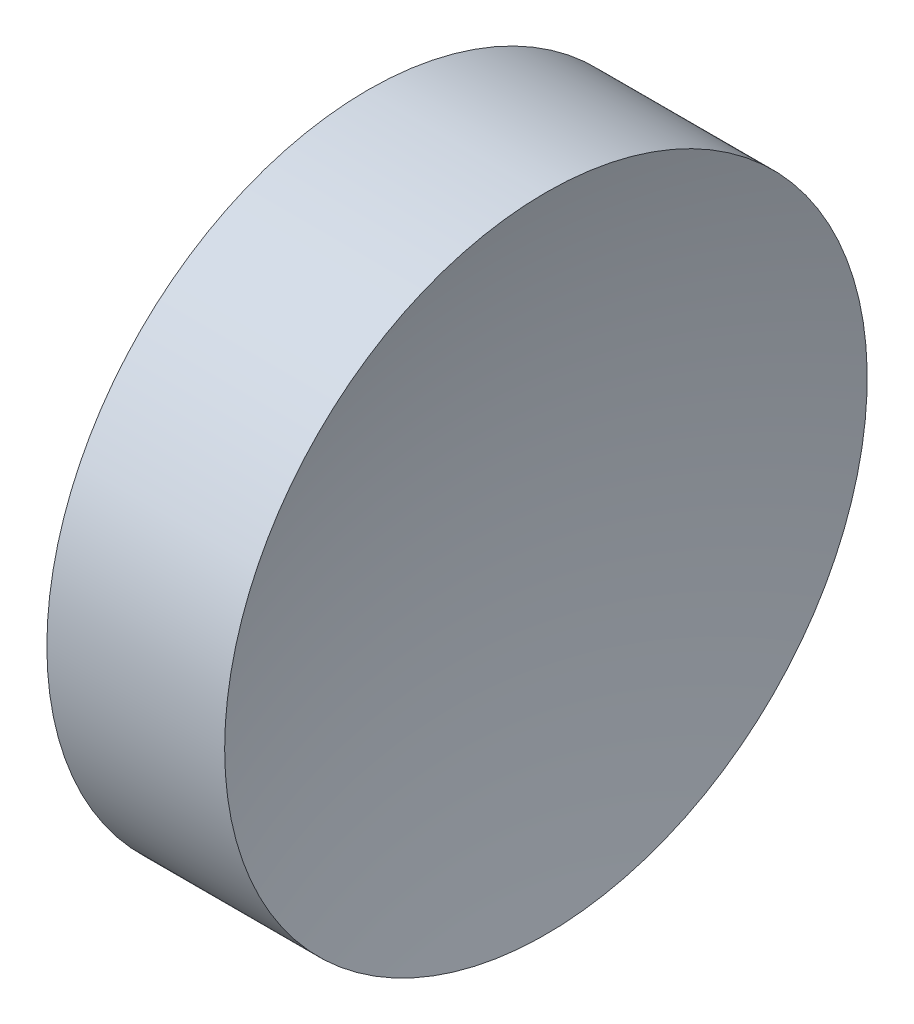
ISO-10303-21;
HEADER;
FILE_DESCRIPTION(('STEP AP214'),'2;1');
FILE_NAME('part.step','',(''),(''),'','','');
FILE_SCHEMA(('AUTOMOTIVE_DESIGN { 1 0 10303 214 1 1 1 1 }'));
ENDSEC;
DATA;
#1=APPLICATION_CONTEXT('core data for automotive mechanical design processes');
#2=APPLICATION_PROTOCOL_DEFINITION('international standard','automotive_design',2000,#1);
#3=PRODUCT_CONTEXT('',#1,'mechanical');
#4=PRODUCT('Part','Part','',(#3));
#5=PRODUCT_RELATED_PRODUCT_CATEGORY('part','',(#4));
#6=PRODUCT_DEFINITION_FORMATION('','',#4);
#7=PRODUCT_DEFINITION_CONTEXT('part definition',#1,'design');
#8=PRODUCT_DEFINITION('design','',#6,#7);
#9=PRODUCT_DEFINITION_SHAPE('','',#8);
#10=(LENGTH_UNIT() NAMED_UNIT(*) SI_UNIT(.MILLI.,.METRE.));
#11=(NAMED_UNIT(*) PLANE_ANGLE_UNIT() SI_UNIT($,.RADIAN.));
#12=(NAMED_UNIT(*) SI_UNIT($,.STERADIAN.) SOLID_ANGLE_UNIT());
#13=UNCERTAINTY_MEASURE_WITH_UNIT(LENGTH_MEASURE(1.E-05),#10,'distance_accuracy_value','');
#14=(GEOMETRIC_REPRESENTATION_CONTEXT(3) GLOBAL_UNCERTAINTY_ASSIGNED_CONTEXT((#13)) GLOBAL_UNIT_ASSIGNED_CONTEXT((#10,
#11,#12)) REPRESENTATION_CONTEXT('',''));
#15=CARTESIAN_POINT('',(0.,0.,0.));
#16=DIRECTION('',(0.,0.,1.));
#17=DIRECTION('',(1.,0.,0.));
#18=AXIS2_PLACEMENT_3D('',#15,#16,#17);
#19=CARTESIAN_POINT('',(168.45270344623,65.2226028729874,0.));
#20=DIRECTION('',(-1.,0.,0.));
#21=DIRECTION('',(0.,1.,0.));
#22=AXIS2_PLACEMENT_3D('',#19,#20,#21);
#23=SPHERICAL_SURFACE('',#22,46.6000000000002);
#24=CARTESIAN_POINT('',(123.616668831201,65.2226028729874,0.));
#25=DIRECTION('',(-1.,0.,0.));
#26=DIRECTION('',(0.,0.,1.));
#27=AXIS2_PLACEMENT_3D('',#24,#25,#26);
#28=CIRCLE('',#27,12.7);
#29=CARTESIAN_POINT('',(123.616668831201,65.2226028729874,12.7));
#30=VERTEX_POINT('',#29);
#31=EDGE_CURVE('E10',#30,#30,#28,.T.);
#32=ORIENTED_EDGE('',*,*,#31,.F.);
#33=EDGE_LOOP('',(#32));
#34=FACE_BOUND('',#33,.T.);
#35=ADVANCED_FACE('F35',(#34),#23,.F.);
#36=CARTESIAN_POINT('',(109.936935226086,65.2226028729874,0.));
#37=DIRECTION('',(-1.,0.,0.));
#38=DIRECTION('',(0.,0.,1.));
#39=AXIS2_PLACEMENT_3D('',#36,#37,#38);
#40=CYLINDRICAL_SURFACE('',#39,12.7);
#41=CARTESIAN_POINT('',(116.588738061257,65.2226028729874,0.));
#42=DIRECTION('',(-1.,0.,0.));
#43=DIRECTION('',(0.,0.,1.));
#44=AXIS2_PLACEMENT_3D('',#41,#42,#43);
#45=CIRCLE('',#44,12.7);
#46=CARTESIAN_POINT('',(116.588738061257,65.2226028729874,12.7));
#47=VERTEX_POINT('',#46);
#48=EDGE_CURVE('E41',#47,#47,#45,.T.);
#49=ORIENTED_EDGE('',*,*,#48,.F.);
#50=EDGE_LOOP('',(#49));
#51=FACE_BOUND('',#50,.T.);
#52=ORIENTED_EDGE('',*,*,#31,.T.);
#53=EDGE_LOOP('',(#52));
#54=FACE_BOUND('',#53,.T.);
#55=ADVANCED_FACE('F49',(#51,#54),#40,.T.);
#56=CARTESIAN_POINT('',(71.7527034462293,65.2226028729874,0.));
#57=DIRECTION('',(-1.,0.,0.));
#58=DIRECTION('',(0.,1.,0.));
#59=AXIS2_PLACEMENT_3D('',#56,#57,#58);
#60=SPHERICAL_SURFACE('',#59,46.6);
#61=ORIENTED_EDGE('',*,*,#48,.T.);
#62=EDGE_LOOP('',(#61));
#63=FACE_BOUND('',#62,.T.);
#64=ADVANCED_FACE('F47',(#63),#60,.F.);
#65=CLOSED_SHELL('',(#35,#55,#64));
#66=MANIFOLD_SOLID_BREP('B2',#65);
#67=ADVANCED_BREP_SHAPE_REPRESENTATION('',(#18,#66),#14);
#68=SHAPE_DEFINITION_REPRESENTATION(#9,#67);
ENDSEC;
END-ISO-10303-21;
